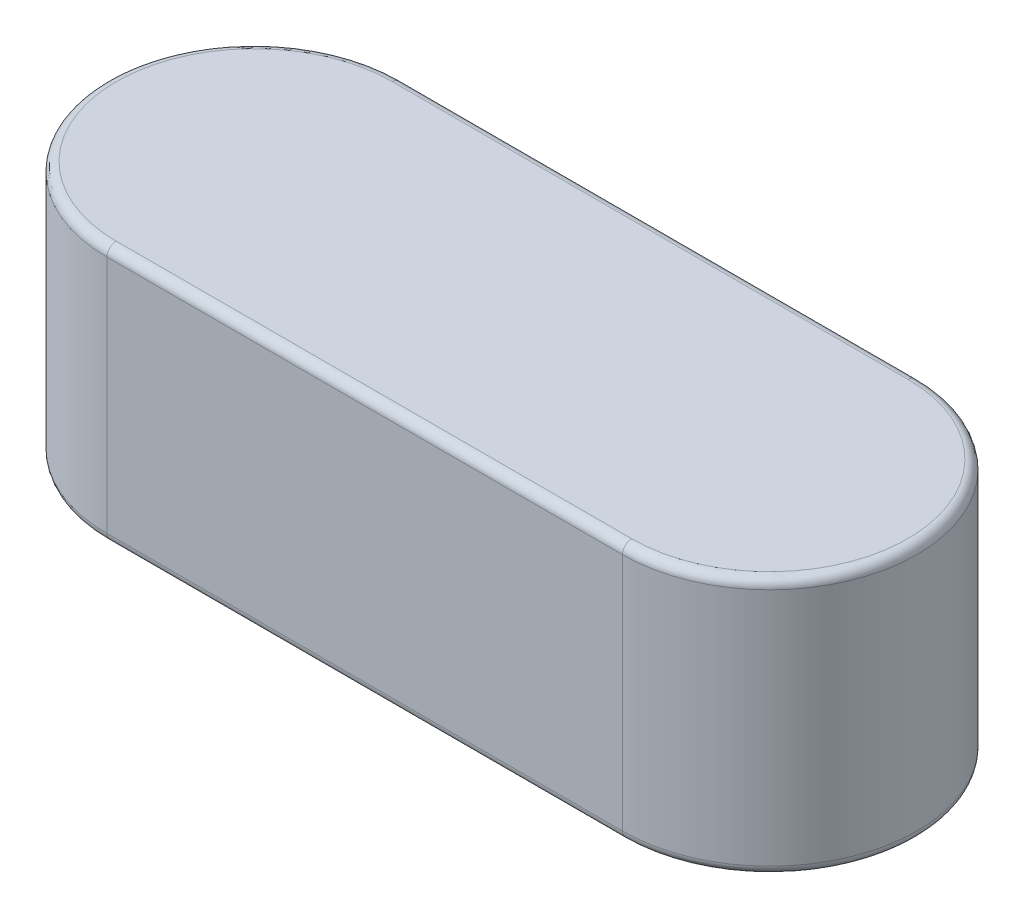
ISO-10303-21;
HEADER;
FILE_DESCRIPTION(('STEP AP214'),'2;1');
FILE_NAME('part.step','',(''),(''),'','','');
FILE_SCHEMA(('AUTOMOTIVE_DESIGN { 1 0 10303 214 1 1 1 1 }'));
ENDSEC;
DATA;
#1=APPLICATION_CONTEXT('core data for automotive mechanical design processes');
#2=APPLICATION_PROTOCOL_DEFINITION('international standard','automotive_design',2000,#1);
#3=PRODUCT_CONTEXT('',#1,'mechanical');
#4=PRODUCT('Part','Part','',(#3));
#5=PRODUCT_RELATED_PRODUCT_CATEGORY('part','',(#4));
#6=PRODUCT_DEFINITION_FORMATION('','',#4);
#7=PRODUCT_DEFINITION_CONTEXT('part definition',#1,'design');
#8=PRODUCT_DEFINITION('design','',#6,#7);
#9=PRODUCT_DEFINITION_SHAPE('','',#8);
#10=(LENGTH_UNIT() NAMED_UNIT(*) SI_UNIT(.MILLI.,.METRE.));
#11=(NAMED_UNIT(*) PLANE_ANGLE_UNIT() SI_UNIT($,.RADIAN.));
#12=(NAMED_UNIT(*) SI_UNIT($,.STERADIAN.) SOLID_ANGLE_UNIT());
#13=UNCERTAINTY_MEASURE_WITH_UNIT(LENGTH_MEASURE(1.E-05),#10,'distance_accuracy_value','');
#14=(GEOMETRIC_REPRESENTATION_CONTEXT(3) GLOBAL_UNCERTAINTY_ASSIGNED_CONTEXT((#13)) GLOBAL_UNIT_ASSIGNED_CONTEXT((#10,
#11,#12)) REPRESENTATION_CONTEXT('',''));
#15=CARTESIAN_POINT('',(0.,0.,0.));
#16=DIRECTION('',(0.,0.,1.));
#17=DIRECTION('',(1.,0.,0.));
#18=AXIS2_PLACEMENT_3D('',#15,#16,#17);
#19=CARTESIAN_POINT('',(-14.,7.00000000000001,0.));
#20=DIRECTION('',(0.,-1.,0.));
#21=DIRECTION('',(0.,0.,-1.));
#22=AXIS2_PLACEMENT_3D('',#19,#20,#21);
#23=CYLINDRICAL_SURFACE('',#22,4.);
#24=DIRECTION('',(0.,-1.,0.));
#25=VECTOR('',#24,1.);
#26=CARTESIAN_POINT('',(-14.,7.00000000000001,-4.));
#27=LINE('',#26,#25);
#28=CARTESIAN_POINT('',(-14.,6.75000000000001,-4.));
#29=VERTEX_POINT('',#28);
#30=CARTESIAN_POINT('',(-14.,0.25,-4.));
#31=VERTEX_POINT('',#30);
#32=EDGE_CURVE('E105',#29,#31,#27,.T.);
#33=ORIENTED_EDGE('',*,*,#32,.T.);
#34=CARTESIAN_POINT('',(-14.,0.25,0.));
#35=DIRECTION('',(0.,1.,0.));
#36=DIRECTION('',(0.,0.,1.));
#37=AXIS2_PLACEMENT_3D('',#34,#35,#36);
#38=CIRCLE('',#37,4.);
#39=CARTESIAN_POINT('',(-14.,0.25,4.));
#40=VERTEX_POINT('',#39);
#41=EDGE_CURVE('E112',#31,#40,#38,.T.);
#42=ORIENTED_EDGE('',*,*,#41,.T.);
#43=DIRECTION('',(0.,-1.,0.));
#44=VECTOR('',#43,1.);
#45=CARTESIAN_POINT('',(-14.,7.00000000000001,4.));
#46=LINE('',#45,#44);
#47=CARTESIAN_POINT('',(-14.,6.75000000000001,4.));
#48=VERTEX_POINT('',#47);
#49=EDGE_CURVE('E107',#48,#40,#46,.T.);
#50=ORIENTED_EDGE('',*,*,#49,.F.);
#51=CARTESIAN_POINT('',(-14.,6.75000000000001,0.));
#52=DIRECTION('',(0.,1.,0.));
#53=DIRECTION('',(0.,0.,1.));
#54=AXIS2_PLACEMENT_3D('',#51,#52,#53);
#55=CIRCLE('',#54,4.);
#56=EDGE_CURVE('E103',#48,#29,#55,.F.);
#57=ORIENTED_EDGE('',*,*,#56,.T.);
#58=EDGE_LOOP('',(#33,#42,#50,#57));
#59=FACE_BOUND('',#58,.T.);
#60=ADVANCED_FACE('F34',(#59),#23,.T.);
#61=CARTESIAN_POINT('',(-14.,7.00000000000001,4.));
#62=DIRECTION('',(0.,0.,-1.));
#63=DIRECTION('',(-1.,0.,0.));
#64=AXIS2_PLACEMENT_3D('',#61,#62,#63);
#65=PLANE('',#64);
#66=ORIENTED_EDGE('',*,*,#49,.T.);
#67=DIRECTION('',(1.,0.,0.));
#68=VECTOR('',#67,1.);
#69=CARTESIAN_POINT('',(-14.,0.25,4.));
#70=LINE('',#69,#68);
#71=CARTESIAN_POINT('',(0.,0.25,4.));
#72=VERTEX_POINT('',#71);
#73=EDGE_CURVE('E156',#40,#72,#70,.T.);
#74=ORIENTED_EDGE('',*,*,#73,.T.);
#75=DIRECTION('',(0.,-1.,0.));
#76=VECTOR('',#75,1.);
#77=CARTESIAN_POINT('',(0.,7.00000000000001,4.));
#78=LINE('',#77,#76);
#79=CARTESIAN_POINT('',(0.,6.75000000000001,4.));
#80=VERTEX_POINT('',#79);
#81=EDGE_CURVE('E137',#80,#72,#78,.T.);
#82=ORIENTED_EDGE('',*,*,#81,.F.);
#83=DIRECTION('',(1.,0.,0.));
#84=VECTOR('',#83,1.);
#85=CARTESIAN_POINT('',(-14.,6.75000000000001,4.));
#86=LINE('',#85,#84);
#87=EDGE_CURVE('E154',#80,#48,#86,.F.);
#88=ORIENTED_EDGE('',*,*,#87,.T.);
#89=EDGE_LOOP('',(#66,#74,#82,#88));
#90=FACE_BOUND('',#89,.T.);
#91=ADVANCED_FACE('F182',(#90),#65,.F.);
#92=CARTESIAN_POINT('',(0.,7.00000000000001,0.));
#93=DIRECTION('',(0.,-1.,0.));
#94=DIRECTION('',(0.,0.,-1.));
#95=AXIS2_PLACEMENT_3D('',#92,#93,#94);
#96=CYLINDRICAL_SURFACE('',#95,4.);
#97=ORIENTED_EDGE('',*,*,#81,.T.);
#98=CARTESIAN_POINT('',(0.,0.25,0.));
#99=DIRECTION('',(0.,1.,0.));
#100=DIRECTION('',(0.,0.,1.));
#101=AXIS2_PLACEMENT_3D('',#98,#99,#100);
#102=CIRCLE('',#101,4.);
#103=CARTESIAN_POINT('',(0.,0.25,-4.));
#104=VERTEX_POINT('',#103);
#105=EDGE_CURVE('E113',#72,#104,#102,.T.);
#106=ORIENTED_EDGE('',*,*,#105,.T.);
#107=DIRECTION('',(0.,-1.,0.));
#108=VECTOR('',#107,1.);
#109=CARTESIAN_POINT('',(0.,7.00000000000001,-4.));
#110=LINE('',#109,#108);
#111=CARTESIAN_POINT('',(0.,6.75000000000001,-4.));
#112=VERTEX_POINT('',#111);
#113=EDGE_CURVE('E124',#112,#104,#110,.T.);
#114=ORIENTED_EDGE('',*,*,#113,.F.);
#115=CARTESIAN_POINT('',(0.,6.75000000000001,0.));
#116=DIRECTION('',(0.,1.,0.));
#117=DIRECTION('',(0.,0.,1.));
#118=AXIS2_PLACEMENT_3D('',#115,#116,#117);
#119=CIRCLE('',#118,4.);
#120=EDGE_CURVE('E149',#112,#80,#119,.F.);
#121=ORIENTED_EDGE('',*,*,#120,.T.);
#122=EDGE_LOOP('',(#97,#106,#114,#121));
#123=FACE_BOUND('',#122,.T.);
#124=ADVANCED_FACE('F180',(#123),#96,.T.);
#125=CARTESIAN_POINT('',(-14.,7.00000000000001,-4.));
#126=DIRECTION('',(0.,0.,1.));
#127=DIRECTION('',(1.,0.,0.));
#128=AXIS2_PLACEMENT_3D('',#125,#126,#127);
#129=PLANE('',#128);
#130=ORIENTED_EDGE('',*,*,#113,.T.);
#131=DIRECTION('',(-1.,0.,0.));
#132=VECTOR('',#131,1.);
#133=CARTESIAN_POINT('',(-14.,0.25,-4.));
#134=LINE('',#133,#132);
#135=EDGE_CURVE('E123',#104,#31,#134,.T.);
#136=ORIENTED_EDGE('',*,*,#135,.T.);
#137=ORIENTED_EDGE('',*,*,#32,.F.);
#138=DIRECTION('',(-1.,0.,0.));
#139=VECTOR('',#138,1.);
#140=CARTESIAN_POINT('',(0.,6.75000000000001,-4.));
#141=LINE('',#140,#139);
#142=EDGE_CURVE('E120',#29,#112,#141,.F.);
#143=ORIENTED_EDGE('',*,*,#142,.T.);
#144=EDGE_LOOP('',(#130,#136,#137,#143));
#145=FACE_BOUND('',#144,.T.);
#146=ADVANCED_FACE('F118',(#145),#129,.F.);
#147=CARTESIAN_POINT('',(-14.,7.00000000000001,0.));
#148=DIRECTION('',(0.,1.,0.));
#149=DIRECTION('',(0.,0.,1.));
#150=AXIS2_PLACEMENT_3D('',#147,#148,#149);
#151=PLANE('',#150);
#152=DIRECTION('',(1.,0.,0.));
#153=VECTOR('',#152,1.);
#154=CARTESIAN_POINT('',(0.,7.00000000000001,3.75));
#155=LINE('',#154,#153);
#156=CARTESIAN_POINT('',(-14.,7.00000000000001,3.75));
#157=VERTEX_POINT('',#156);
#158=CARTESIAN_POINT('',(0.,7.00000000000001,3.75));
#159=VERTEX_POINT('',#158);
#160=EDGE_CURVE('E43',#157,#159,#155,.T.);
#161=ORIENTED_EDGE('',*,*,#160,.T.);
#162=CARTESIAN_POINT('',(0.,7.00000000000001,0.));
#163=DIRECTION('',(0.,1.,0.));
#164=DIRECTION('',(0.,0.,1.));
#165=AXIS2_PLACEMENT_3D('',#162,#163,#164);
#166=CIRCLE('',#165,3.75);
#167=CARTESIAN_POINT('',(0.,7.00000000000001,-3.75));
#168=VERTEX_POINT('',#167);
#169=EDGE_CURVE('E11',#159,#168,#166,.T.);
#170=ORIENTED_EDGE('',*,*,#169,.T.);
#171=DIRECTION('',(-1.,0.,0.));
#172=VECTOR('',#171,1.);
#173=CARTESIAN_POINT('',(-14.,7.00000000000001,-3.75));
#174=LINE('',#173,#172);
#175=CARTESIAN_POINT('',(-14.,7.00000000000001,-3.75));
#176=VERTEX_POINT('',#175);
#177=EDGE_CURVE('E159',#168,#176,#174,.T.);
#178=ORIENTED_EDGE('',*,*,#177,.T.);
#179=CARTESIAN_POINT('',(-14.,7.00000000000001,0.));
#180=DIRECTION('',(0.,1.,0.));
#181=DIRECTION('',(0.,0.,1.));
#182=AXIS2_PLACEMENT_3D('',#179,#180,#181);
#183=CIRCLE('',#182,3.75);
#184=EDGE_CURVE('E130',#176,#157,#183,.T.);
#185=ORIENTED_EDGE('',*,*,#184,.T.);
#186=EDGE_LOOP('',(#161,#170,#178,#185));
#187=FACE_BOUND('',#186,.T.);
#188=ADVANCED_FACE('F205',(#187),#151,.T.);
#189=CARTESIAN_POINT('',(-14.,0.,0.));
#190=DIRECTION('',(0.,1.,0.));
#191=DIRECTION('',(0.,0.,1.));
#192=AXIS2_PLACEMENT_3D('',#189,#190,#191);
#193=PLANE('',#192);
#194=CARTESIAN_POINT('',(-14.,0.,0.));
#195=DIRECTION('',(0.,1.,0.));
#196=DIRECTION('',(0.,0.,1.));
#197=AXIS2_PLACEMENT_3D('',#194,#195,#196);
#198=CIRCLE('',#197,3.75);
#199=CARTESIAN_POINT('',(-14.,0.,3.75));
#200=VERTEX_POINT('',#199);
#201=CARTESIAN_POINT('',(-14.,0.,-3.75));
#202=VERTEX_POINT('',#201);
#203=EDGE_CURVE('E142',#200,#202,#198,.F.);
#204=ORIENTED_EDGE('',*,*,#203,.T.);
#205=DIRECTION('',(-1.,0.,0.));
#206=VECTOR('',#205,1.);
#207=CARTESIAN_POINT('',(-14.,0.,-3.75));
#208=LINE('',#207,#206);
#209=CARTESIAN_POINT('',(0.,0.,-3.75));
#210=VERTEX_POINT('',#209);
#211=EDGE_CURVE('E146',#202,#210,#208,.F.);
#212=ORIENTED_EDGE('',*,*,#211,.T.);
#213=CARTESIAN_POINT('',(0.,0.,0.));
#214=DIRECTION('',(0.,1.,0.));
#215=DIRECTION('',(0.,0.,1.));
#216=AXIS2_PLACEMENT_3D('',#213,#214,#215);
#217=CIRCLE('',#216,3.75);
#218=CARTESIAN_POINT('',(0.,0.,3.75));
#219=VERTEX_POINT('',#218);
#220=EDGE_CURVE('E144',#210,#219,#217,.F.);
#221=ORIENTED_EDGE('',*,*,#220,.T.);
#222=DIRECTION('',(1.,0.,0.));
#223=VECTOR('',#222,1.);
#224=CARTESIAN_POINT('',(-14.,0.,3.75));
#225=LINE('',#224,#223);
#226=EDGE_CURVE('E135',#219,#200,#225,.F.);
#227=ORIENTED_EDGE('',*,*,#226,.T.);
#228=EDGE_LOOP('',(#204,#212,#221,#227));
#229=FACE_BOUND('',#228,.T.);
#230=ADVANCED_FACE('F203',(#229),#193,.F.);
#231=CARTESIAN_POINT('',(-14.,0.25,3.75));
#232=DIRECTION('',(1.,0.,0.));
#233=DIRECTION('',(0.,0.,-1.));
#234=AXIS2_PLACEMENT_3D('',#231,#232,#233);
#235=CYLINDRICAL_SURFACE('',#234,0.25);
#236=CARTESIAN_POINT('',(-14.,0.25,3.75));
#237=DIRECTION('',(-1.,0.,0.));
#238=DIRECTION('',(0.,0.,1.));
#239=AXIS2_PLACEMENT_3D('',#236,#237,#238);
#240=CIRCLE('',#239,0.25);
#241=EDGE_CURVE('E166',#200,#40,#240,.T.);
#242=ORIENTED_EDGE('',*,*,#241,.F.);
#243=ORIENTED_EDGE('',*,*,#226,.F.);
#244=CARTESIAN_POINT('',(0.,0.25,3.75));
#245=DIRECTION('',(1.,0.,0.));
#246=DIRECTION('',(0.,0.,-1.));
#247=AXIS2_PLACEMENT_3D('',#244,#245,#246);
#248=CIRCLE('',#247,0.25);
#249=EDGE_CURVE('E125',#72,#219,#248,.T.);
#250=ORIENTED_EDGE('',*,*,#249,.F.);
#251=ORIENTED_EDGE('',*,*,#73,.F.);
#252=EDGE_LOOP('',(#242,#243,#250,#251));
#253=FACE_BOUND('',#252,.T.);
#254=ADVANCED_FACE('F200',(#253),#235,.T.);
#255=CARTESIAN_POINT('',(0.,0.25,0.));
#256=DIRECTION('',(0.,1.,0.));
#257=DIRECTION('',(0.,0.,1.));
#258=AXIS2_PLACEMENT_3D('',#255,#256,#257);
#259=TOROIDAL_SURFACE('',#258,3.75,0.25);
#260=ORIENTED_EDGE('',*,*,#249,.T.);
#261=ORIENTED_EDGE('',*,*,#220,.F.);
#262=CARTESIAN_POINT('',(0.,0.25,-3.75));
#263=DIRECTION('',(-1.,0.,0.));
#264=DIRECTION('',(0.,0.,1.));
#265=AXIS2_PLACEMENT_3D('',#262,#263,#264);
#266=CIRCLE('',#265,0.25);
#267=EDGE_CURVE('E164',#104,#210,#266,.T.);
#268=ORIENTED_EDGE('',*,*,#267,.F.);
#269=ORIENTED_EDGE('',*,*,#105,.F.);
#270=EDGE_LOOP('',(#260,#261,#268,#269));
#271=FACE_BOUND('',#270,.T.);
#272=ADVANCED_FACE('F189',(#271),#259,.T.);
#273=CARTESIAN_POINT('',(-14.,0.25,0.));
#274=DIRECTION('',(0.,1.,0.));
#275=DIRECTION('',(0.,0.,1.));
#276=AXIS2_PLACEMENT_3D('',#273,#274,#275);
#277=TOROIDAL_SURFACE('',#276,3.75,0.25);
#278=ORIENTED_EDGE('',*,*,#241,.T.);
#279=ORIENTED_EDGE('',*,*,#41,.F.);
#280=CARTESIAN_POINT('',(-14.,0.25,-3.75));
#281=DIRECTION('',(1.,0.,0.));
#282=DIRECTION('',(0.,0.,-1.));
#283=AXIS2_PLACEMENT_3D('',#280,#281,#282);
#284=CIRCLE('',#283,0.25);
#285=EDGE_CURVE('E162',#202,#31,#284,.T.);
#286=ORIENTED_EDGE('',*,*,#285,.F.);
#287=ORIENTED_EDGE('',*,*,#203,.F.);
#288=EDGE_LOOP('',(#278,#279,#286,#287));
#289=FACE_BOUND('',#288,.T.);
#290=ADVANCED_FACE('F197',(#289),#277,.T.);
#291=CARTESIAN_POINT('',(-14.,0.25,-3.75));
#292=DIRECTION('',(-1.,0.,0.));
#293=DIRECTION('',(0.,0.,1.));
#294=AXIS2_PLACEMENT_3D('',#291,#292,#293);
#295=CYLINDRICAL_SURFACE('',#294,0.25);
#296=ORIENTED_EDGE('',*,*,#267,.T.);
#297=ORIENTED_EDGE('',*,*,#211,.F.);
#298=ORIENTED_EDGE('',*,*,#285,.T.);
#299=ORIENTED_EDGE('',*,*,#135,.F.);
#300=EDGE_LOOP('',(#296,#297,#298,#299));
#301=FACE_BOUND('',#300,.T.);
#302=ADVANCED_FACE('F192',(#301),#295,.T.);
#303=CARTESIAN_POINT('',(-14.,6.75000000000001,0.));
#304=DIRECTION('',(0.,1.,0.));
#305=DIRECTION('',(0.,0.,1.));
#306=AXIS2_PLACEMENT_3D('',#303,#304,#305);
#307=TOROIDAL_SURFACE('',#306,3.75,0.25);
#308=CARTESIAN_POINT('',(-14.,6.75000000000001,-3.75));
#309=DIRECTION('',(1.,0.,0.));
#310=DIRECTION('',(0.,0.,-1.));
#311=AXIS2_PLACEMENT_3D('',#308,#309,#310);
#312=CIRCLE('',#311,0.25);
#313=EDGE_CURVE('E129',#29,#176,#312,.T.);
#314=ORIENTED_EDGE('',*,*,#313,.F.);
#315=ORIENTED_EDGE('',*,*,#56,.F.);
#316=CARTESIAN_POINT('',(-14.,6.75000000000001,3.75));
#317=DIRECTION('',(1.,0.,0.));
#318=DIRECTION('',(0.,0.,-1.));
#319=AXIS2_PLACEMENT_3D('',#316,#317,#318);
#320=CIRCLE('',#319,0.25);
#321=EDGE_CURVE('E38',#157,#48,#320,.T.);
#322=ORIENTED_EDGE('',*,*,#321,.F.);
#323=ORIENTED_EDGE('',*,*,#184,.F.);
#324=EDGE_LOOP('',(#314,#315,#322,#323));
#325=FACE_BOUND('',#324,.T.);
#326=ADVANCED_FACE('F36',(#325),#307,.T.);
#327=CARTESIAN_POINT('',(-14.,6.75000000000001,3.75));
#328=DIRECTION('',(-1.,0.,0.));
#329=DIRECTION('',(0.,0.,1.));
#330=AXIS2_PLACEMENT_3D('',#327,#328,#329);
#331=CYLINDRICAL_SURFACE('',#330,0.25);
#332=ORIENTED_EDGE('',*,*,#321,.T.);
#333=ORIENTED_EDGE('',*,*,#87,.F.);
#334=CARTESIAN_POINT('',(0.,6.75000000000001,3.75));
#335=DIRECTION('',(1.,0.,0.));
#336=DIRECTION('',(0.,0.,-1.));
#337=AXIS2_PLACEMENT_3D('',#334,#335,#336);
#338=CIRCLE('',#337,0.25);
#339=EDGE_CURVE('E132',#159,#80,#338,.T.);
#340=ORIENTED_EDGE('',*,*,#339,.F.);
#341=ORIENTED_EDGE('',*,*,#160,.F.);
#342=EDGE_LOOP('',(#332,#333,#340,#341));
#343=FACE_BOUND('',#342,.T.);
#344=ADVANCED_FACE('F175',(#343),#331,.T.);
#345=CARTESIAN_POINT('',(-14.,6.75000000000001,-3.75));
#346=DIRECTION('',(1.,0.,0.));
#347=DIRECTION('',(0.,0.,-1.));
#348=AXIS2_PLACEMENT_3D('',#345,#346,#347);
#349=CYLINDRICAL_SURFACE('',#348,0.25);
#350=ORIENTED_EDGE('',*,*,#313,.T.);
#351=ORIENTED_EDGE('',*,*,#177,.F.);
#352=CARTESIAN_POINT('',(0.,6.75000000000001,-3.75));
#353=DIRECTION('',(1.,0.,0.));
#354=DIRECTION('',(0.,0.,-1.));
#355=AXIS2_PLACEMENT_3D('',#352,#353,#354);
#356=CIRCLE('',#355,0.25);
#357=EDGE_CURVE('E57',#112,#168,#356,.T.);
#358=ORIENTED_EDGE('',*,*,#357,.F.);
#359=ORIENTED_EDGE('',*,*,#142,.F.);
#360=EDGE_LOOP('',(#350,#351,#358,#359));
#361=FACE_BOUND('',#360,.T.);
#362=ADVANCED_FACE('F133',(#361),#349,.T.);
#363=CARTESIAN_POINT('',(0.,6.75000000000001,0.));
#364=DIRECTION('',(0.,1.,0.));
#365=DIRECTION('',(0.,0.,1.));
#366=AXIS2_PLACEMENT_3D('',#363,#364,#365);
#367=TOROIDAL_SURFACE('',#366,3.75,0.25);
#368=ORIENTED_EDGE('',*,*,#339,.T.);
#369=ORIENTED_EDGE('',*,*,#120,.F.);
#370=ORIENTED_EDGE('',*,*,#357,.T.);
#371=ORIENTED_EDGE('',*,*,#169,.F.);
#372=EDGE_LOOP('',(#368,#369,#370,#371));
#373=FACE_BOUND('',#372,.T.);
#374=ADVANCED_FACE('F173',(#373),#367,.T.);
#375=CLOSED_SHELL('',(#60,#91,#124,#146,#188,#230,#254,#272,#290,#302,#326,#344,#362,#374));
#376=MANIFOLD_SOLID_BREP('B2',#375);
#377=ADVANCED_BREP_SHAPE_REPRESENTATION('',(#18,#376),#14);
#378=SHAPE_DEFINITION_REPRESENTATION(#9,#377);
ENDSEC;
END-ISO-10303-21;
